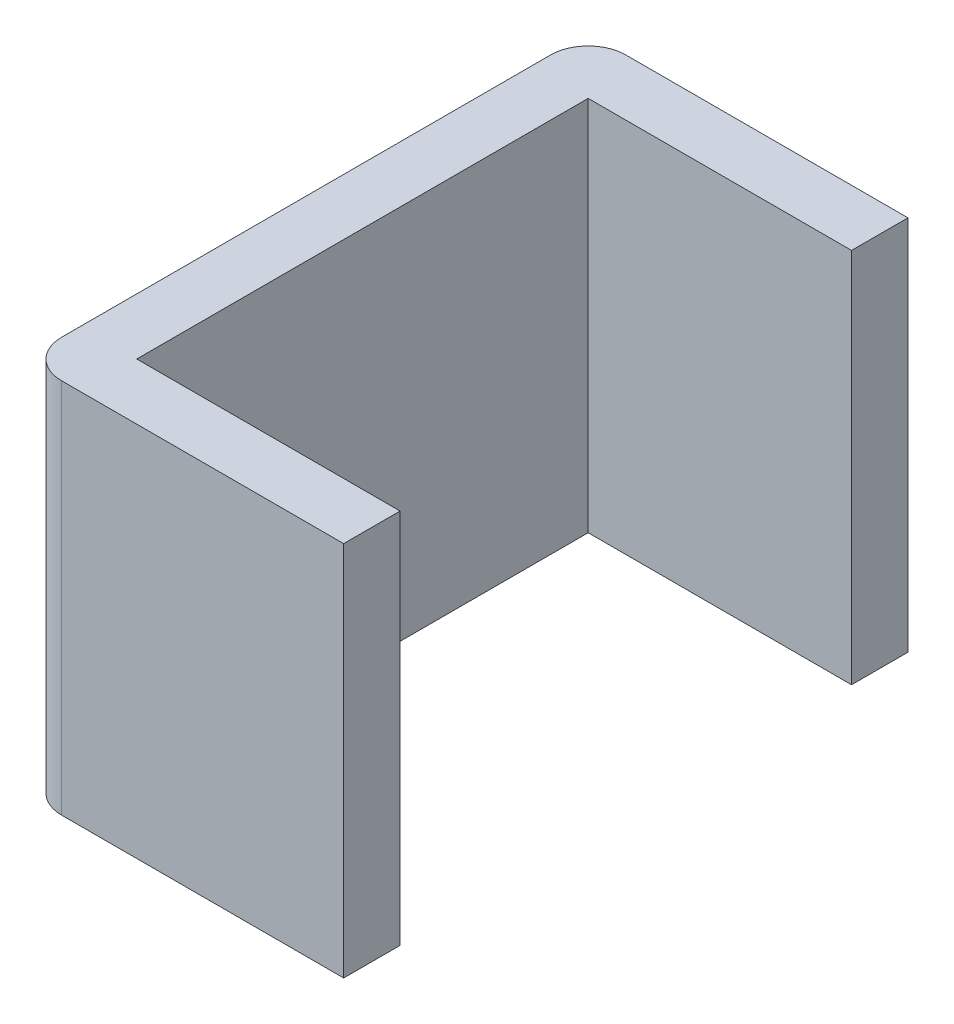
ISO-10303-21;
HEADER;
FILE_DESCRIPTION(('STEP AP214'),'2;1');
FILE_NAME('part.step','',(''),(''),'','','');
FILE_SCHEMA(('AUTOMOTIVE_DESIGN { 1 0 10303 214 1 1 1 1 }'));
ENDSEC;
DATA;
#1=APPLICATION_CONTEXT('core data for automotive mechanical design processes');
#2=APPLICATION_PROTOCOL_DEFINITION('international standard','automotive_design',2000,#1);
#3=PRODUCT_CONTEXT('',#1,'mechanical');
#4=PRODUCT('Part','Part','',(#3));
#5=PRODUCT_RELATED_PRODUCT_CATEGORY('part','',(#4));
#6=PRODUCT_DEFINITION_FORMATION('','',#4);
#7=PRODUCT_DEFINITION_CONTEXT('part definition',#1,'design');
#8=PRODUCT_DEFINITION('design','',#6,#7);
#9=PRODUCT_DEFINITION_SHAPE('','',#8);
#10=(LENGTH_UNIT() NAMED_UNIT(*) SI_UNIT(.MILLI.,.METRE.));
#11=(NAMED_UNIT(*) PLANE_ANGLE_UNIT() SI_UNIT($,.RADIAN.));
#12=(NAMED_UNIT(*) SI_UNIT($,.STERADIAN.) SOLID_ANGLE_UNIT());
#13=UNCERTAINTY_MEASURE_WITH_UNIT(LENGTH_MEASURE(1.E-05),#10,'distance_accuracy_value','');
#14=(GEOMETRIC_REPRESENTATION_CONTEXT(3) GLOBAL_UNCERTAINTY_ASSIGNED_CONTEXT((#13)) GLOBAL_UNIT_ASSIGNED_CONTEXT((#10,
#11,#12)) REPRESENTATION_CONTEXT('',''));
#15=CARTESIAN_POINT('',(0.,0.,0.));
#16=DIRECTION('',(0.,0.,1.));
#17=DIRECTION('',(1.,0.,0.));
#18=AXIS2_PLACEMENT_3D('',#15,#16,#17);
#19=CARTESIAN_POINT('',(0.,20.,-3.));
#20=DIRECTION('',(-1.,0.,0.));
#21=DIRECTION('',(0.,0.,1.));
#22=AXIS2_PLACEMENT_3D('',#19,#20,#21);
#23=PLANE('',#22);
#24=DIRECTION('',(0.,0.,-1.));
#25=VECTOR('',#24,1.);
#26=CARTESIAN_POINT('',(0.,0.,-3.));
#27=LINE('',#26,#25);
#28=CARTESIAN_POINT('',(0.,0.,0.));
#29=VERTEX_POINT('',#28);
#30=CARTESIAN_POINT('',(0.,0.,-3.));
#31=VERTEX_POINT('',#30);
#32=EDGE_CURVE('E143',#29,#31,#27,.T.);
#33=ORIENTED_EDGE('',*,*,#32,.T.);
#34=DIRECTION('',(0.,-1.,0.));
#35=VECTOR('',#34,1.);
#36=CARTESIAN_POINT('',(0.,20.,-3.));
#37=LINE('',#36,#35);
#38=CARTESIAN_POINT('',(0.,20.,-3.));
#39=VERTEX_POINT('',#38);
#40=EDGE_CURVE('E124',#39,#31,#37,.T.);
#41=ORIENTED_EDGE('',*,*,#40,.F.);
#42=DIRECTION('',(0.,0.,-1.));
#43=VECTOR('',#42,1.);
#44=CARTESIAN_POINT('',(0.,20.,-3.));
#45=LINE('',#44,#43);
#46=CARTESIAN_POINT('',(0.,20.,0.));
#47=VERTEX_POINT('',#46);
#48=EDGE_CURVE('E131',#47,#39,#45,.T.);
#49=ORIENTED_EDGE('',*,*,#48,.F.);
#50=DIRECTION('',(0.,-1.,0.));
#51=VECTOR('',#50,1.);
#52=CARTESIAN_POINT('',(0.,20.,0.));
#53=LINE('',#52,#51);
#54=EDGE_CURVE('E204',#47,#29,#53,.T.);
#55=ORIENTED_EDGE('',*,*,#54,.T.);
#56=EDGE_LOOP('',(#33,#41,#49,#55));
#57=FACE_BOUND('',#56,.T.);
#58=ADVANCED_FACE('F39',(#57),#23,.F.);
#59=CARTESIAN_POINT('',(0.,20.,-3.));
#60=DIRECTION('',(0.,0.,1.));
#61=DIRECTION('',(1.,0.,0.));
#62=AXIS2_PLACEMENT_3D('',#59,#60,#61);
#63=PLANE('',#62);
#64=DIRECTION('',(-1.,0.,0.));
#65=VECTOR('',#64,1.);
#66=CARTESIAN_POINT('',(0.,0.,-3.));
#67=LINE('',#66,#65);
#68=CARTESIAN_POINT('',(-14.,0.,-3.));
#69=VERTEX_POINT('',#68);
#70=EDGE_CURVE('E226',#31,#69,#67,.T.);
#71=ORIENTED_EDGE('',*,*,#70,.T.);
#72=DIRECTION('',(0.,-1.,0.));
#73=VECTOR('',#72,1.);
#74=CARTESIAN_POINT('',(-14.,20.,-3.));
#75=LINE('',#74,#73);
#76=CARTESIAN_POINT('',(-14.,20.,-3.));
#77=VERTEX_POINT('',#76);
#78=EDGE_CURVE('E127',#77,#69,#75,.T.);
#79=ORIENTED_EDGE('',*,*,#78,.F.);
#80=DIRECTION('',(-1.,0.,0.));
#81=VECTOR('',#80,1.);
#82=CARTESIAN_POINT('',(0.,20.,-3.));
#83=LINE('',#82,#81);
#84=EDGE_CURVE('E120',#39,#77,#83,.T.);
#85=ORIENTED_EDGE('',*,*,#84,.F.);
#86=ORIENTED_EDGE('',*,*,#40,.T.);
#87=EDGE_LOOP('',(#71,#79,#85,#86));
#88=FACE_BOUND('',#87,.T.);
#89=ADVANCED_FACE('F122',(#88),#63,.F.);
#90=CARTESIAN_POINT('',(-14.,20.,-3.));
#91=DIRECTION('',(-1.,0.,0.));
#92=DIRECTION('',(0.,0.,1.));
#93=AXIS2_PLACEMENT_3D('',#90,#91,#92);
#94=PLANE('',#93);
#95=DIRECTION('',(0.,0.,-1.));
#96=VECTOR('',#95,1.);
#97=CARTESIAN_POINT('',(-14.,0.,-3.));
#98=LINE('',#97,#96);
#99=CARTESIAN_POINT('',(-14.,0.,-27.));
#100=VERTEX_POINT('',#99);
#101=EDGE_CURVE('E223',#69,#100,#98,.T.);
#102=ORIENTED_EDGE('',*,*,#101,.T.);
#103=DIRECTION('',(0.,-1.,0.));
#104=VECTOR('',#103,1.);
#105=CARTESIAN_POINT('',(-14.,20.,-27.));
#106=LINE('',#105,#104);
#107=CARTESIAN_POINT('',(-14.,20.,-27.));
#108=VERTEX_POINT('',#107);
#109=EDGE_CURVE('E151',#108,#100,#106,.T.);
#110=ORIENTED_EDGE('',*,*,#109,.F.);
#111=DIRECTION('',(0.,0.,-1.));
#112=VECTOR('',#111,1.);
#113=CARTESIAN_POINT('',(-14.,20.,-3.));
#114=LINE('',#113,#112);
#115=EDGE_CURVE('E130',#77,#108,#114,.T.);
#116=ORIENTED_EDGE('',*,*,#115,.F.);
#117=ORIENTED_EDGE('',*,*,#78,.T.);
#118=EDGE_LOOP('',(#102,#110,#116,#117));
#119=FACE_BOUND('',#118,.T.);
#120=ADVANCED_FACE('F243',(#119),#94,.F.);
#121=CARTESIAN_POINT('',(-14.,20.,-27.));
#122=DIRECTION('',(0.,0.,-1.));
#123=DIRECTION('',(-1.,0.,0.));
#124=AXIS2_PLACEMENT_3D('',#121,#122,#123);
#125=PLANE('',#124);
#126=DIRECTION('',(1.,0.,0.));
#127=VECTOR('',#126,1.);
#128=CARTESIAN_POINT('',(-14.,0.,-27.));
#129=LINE('',#128,#127);
#130=CARTESIAN_POINT('',(0.,0.,-27.));
#131=VERTEX_POINT('',#130);
#132=EDGE_CURVE('E198',#100,#131,#129,.T.);
#133=ORIENTED_EDGE('',*,*,#132,.T.);
#134=DIRECTION('',(0.,-1.,0.));
#135=VECTOR('',#134,1.);
#136=CARTESIAN_POINT('',(0.,20.,-27.));
#137=LINE('',#136,#135);
#138=CARTESIAN_POINT('',(0.,20.,-27.));
#139=VERTEX_POINT('',#138);
#140=EDGE_CURVE('E209',#139,#131,#137,.T.);
#141=ORIENTED_EDGE('',*,*,#140,.F.);
#142=DIRECTION('',(1.,0.,0.));
#143=VECTOR('',#142,1.);
#144=CARTESIAN_POINT('',(-14.,20.,-27.));
#145=LINE('',#144,#143);
#146=EDGE_CURVE('E220',#108,#139,#145,.T.);
#147=ORIENTED_EDGE('',*,*,#146,.F.);
#148=ORIENTED_EDGE('',*,*,#109,.T.);
#149=EDGE_LOOP('',(#133,#141,#147,#148));
#150=FACE_BOUND('',#149,.T.);
#151=ADVANCED_FACE('F218',(#150),#125,.F.);
#152=CARTESIAN_POINT('',(0.,20.,-30.));
#153=DIRECTION('',(-1.,0.,0.));
#154=DIRECTION('',(0.,0.,1.));
#155=AXIS2_PLACEMENT_3D('',#152,#153,#154);
#156=PLANE('',#155);
#157=DIRECTION('',(0.,0.,-1.));
#158=VECTOR('',#157,1.);
#159=CARTESIAN_POINT('',(0.,0.,-30.));
#160=LINE('',#159,#158);
#161=CARTESIAN_POINT('',(0.,0.,-30.));
#162=VERTEX_POINT('',#161);
#163=EDGE_CURVE('E193',#131,#162,#160,.T.);
#164=ORIENTED_EDGE('',*,*,#163,.T.);
#165=DIRECTION('',(0.,-1.,0.));
#166=VECTOR('',#165,1.);
#167=CARTESIAN_POINT('',(0.,20.,-30.));
#168=LINE('',#167,#166);
#169=CARTESIAN_POINT('',(0.,20.,-30.));
#170=VERTEX_POINT('',#169);
#171=EDGE_CURVE('E191',#170,#162,#168,.T.);
#172=ORIENTED_EDGE('',*,*,#171,.F.);
#173=DIRECTION('',(0.,0.,-1.));
#174=VECTOR('',#173,1.);
#175=CARTESIAN_POINT('',(0.,20.,-30.));
#176=LINE('',#175,#174);
#177=EDGE_CURVE('E237',#139,#170,#176,.T.);
#178=ORIENTED_EDGE('',*,*,#177,.F.);
#179=ORIENTED_EDGE('',*,*,#140,.T.);
#180=EDGE_LOOP('',(#164,#172,#178,#179));
#181=FACE_BOUND('',#180,.T.);
#182=ADVANCED_FACE('F250',(#181),#156,.F.);
#183=CARTESIAN_POINT('',(-17.,20.,-30.));
#184=DIRECTION('',(0.,0.,1.));
#185=DIRECTION('',(1.,0.,0.));
#186=AXIS2_PLACEMENT_3D('',#183,#184,#185);
#187=PLANE('',#186);
#188=DIRECTION('',(-1.,0.,0.));
#189=VECTOR('',#188,1.);
#190=CARTESIAN_POINT('',(-17.,0.,-30.));
#191=LINE('',#190,#189);
#192=CARTESIAN_POINT('',(-15.,0.,-30.));
#193=VERTEX_POINT('',#192);
#194=EDGE_CURVE('E186',#162,#193,#191,.T.);
#195=ORIENTED_EDGE('',*,*,#194,.T.);
#196=DIRECTION('',(0.,-1.,0.));
#197=VECTOR('',#196,1.);
#198=CARTESIAN_POINT('',(-15.,20.,-30.));
#199=LINE('',#198,#197);
#200=CARTESIAN_POINT('',(-15.,20.,-30.));
#201=VERTEX_POINT('',#200);
#202=EDGE_CURVE('E63',#193,#201,#199,.F.);
#203=ORIENTED_EDGE('',*,*,#202,.T.);
#204=DIRECTION('',(-1.,0.,0.));
#205=VECTOR('',#204,1.);
#206=CARTESIAN_POINT('',(-17.,20.,-30.));
#207=LINE('',#206,#205);
#208=EDGE_CURVE('E171',#170,#201,#207,.T.);
#209=ORIENTED_EDGE('',*,*,#208,.F.);
#210=ORIENTED_EDGE('',*,*,#171,.T.);
#211=EDGE_LOOP('',(#195,#203,#209,#210));
#212=FACE_BOUND('',#211,.T.);
#213=ADVANCED_FACE('F189',(#212),#187,.F.);
#214=CARTESIAN_POINT('',(-17.,20.,0.));
#215=DIRECTION('',(1.,0.,0.));
#216=DIRECTION('',(0.,0.,-1.));
#217=AXIS2_PLACEMENT_3D('',#214,#215,#216);
#218=PLANE('',#217);
#219=DIRECTION('',(0.,0.,1.));
#220=VECTOR('',#219,1.);
#221=CARTESIAN_POINT('',(-17.,20.,0.));
#222=LINE('',#221,#220);
#223=CARTESIAN_POINT('',(-17.,20.,-28.));
#224=VERTEX_POINT('',#223);
#225=CARTESIAN_POINT('',(-17.,20.,-2.));
#226=VERTEX_POINT('',#225);
#227=EDGE_CURVE('E170',#224,#226,#222,.T.);
#228=ORIENTED_EDGE('',*,*,#227,.F.);
#229=DIRECTION('',(0.,-1.,0.));
#230=VECTOR('',#229,1.);
#231=CARTESIAN_POINT('',(-17.,20.,-28.));
#232=LINE('',#231,#230);
#233=CARTESIAN_POINT('',(-17.,0.,-28.));
#234=VERTEX_POINT('',#233);
#235=EDGE_CURVE('E149',#224,#234,#232,.T.);
#236=ORIENTED_EDGE('',*,*,#235,.T.);
#237=DIRECTION('',(0.,0.,1.));
#238=VECTOR('',#237,1.);
#239=CARTESIAN_POINT('',(-17.,0.,0.));
#240=LINE('',#239,#238);
#241=CARTESIAN_POINT('',(-17.,0.,-2.));
#242=VERTEX_POINT('',#241);
#243=EDGE_CURVE('E187',#234,#242,#240,.T.);
#244=ORIENTED_EDGE('',*,*,#243,.T.);
#245=DIRECTION('',(0.,-1.,0.));
#246=VECTOR('',#245,1.);
#247=CARTESIAN_POINT('',(-17.,20.,-2.));
#248=LINE('',#247,#246);
#249=EDGE_CURVE('E145',#242,#226,#248,.F.);
#250=ORIENTED_EDGE('',*,*,#249,.T.);
#251=EDGE_LOOP('',(#228,#236,#244,#250));
#252=FACE_BOUND('',#251,.T.);
#253=ADVANCED_FACE('F175',(#252),#218,.F.);
#254=CARTESIAN_POINT('',(0.,20.,0.));
#255=DIRECTION('',(0.,0.,-1.));
#256=DIRECTION('',(-1.,0.,0.));
#257=AXIS2_PLACEMENT_3D('',#254,#255,#256);
#258=PLANE('',#257);
#259=DIRECTION('',(1.,0.,0.));
#260=VECTOR('',#259,1.);
#261=CARTESIAN_POINT('',(0.,20.,0.));
#262=LINE('',#261,#260);
#263=CARTESIAN_POINT('',(-15.,20.,0.));
#264=VERTEX_POINT('',#263);
#265=EDGE_CURVE('E135',#264,#47,#262,.T.);
#266=ORIENTED_EDGE('',*,*,#265,.F.);
#267=DIRECTION('',(0.,-1.,0.));
#268=VECTOR('',#267,1.);
#269=CARTESIAN_POINT('',(-15.,20.,0.));
#270=LINE('',#269,#268);
#271=CARTESIAN_POINT('',(-15.,0.,0.));
#272=VERTEX_POINT('',#271);
#273=EDGE_CURVE('E11',#264,#272,#270,.T.);
#274=ORIENTED_EDGE('',*,*,#273,.T.);
#275=DIRECTION('',(1.,0.,0.));
#276=VECTOR('',#275,1.);
#277=CARTESIAN_POINT('',(0.,0.,0.));
#278=LINE('',#277,#276);
#279=EDGE_CURVE('E140',#272,#29,#278,.T.);
#280=ORIENTED_EDGE('',*,*,#279,.T.);
#281=ORIENTED_EDGE('',*,*,#54,.F.);
#282=EDGE_LOOP('',(#266,#274,#280,#281));
#283=FACE_BOUND('',#282,.T.);
#284=ADVANCED_FACE('F267',(#283),#258,.F.);
#285=CARTESIAN_POINT('',(0.,20.,0.));
#286=DIRECTION('',(0.,-1.,0.));
#287=DIRECTION('',(0.,0.,-1.));
#288=AXIS2_PLACEMENT_3D('',#285,#286,#287);
#289=PLANE('',#288);
#290=ORIENTED_EDGE('',*,*,#208,.T.);
#291=CARTESIAN_POINT('',(-15.,20.,-28.));
#292=DIRECTION('',(0.,-1.,0.));
#293=DIRECTION('',(0.,0.,-1.));
#294=AXIS2_PLACEMENT_3D('',#291,#292,#293);
#295=CIRCLE('',#294,2.);
#296=EDGE_CURVE('E48',#201,#224,#295,.F.);
#297=ORIENTED_EDGE('',*,*,#296,.T.);
#298=ORIENTED_EDGE('',*,*,#227,.T.);
#299=CARTESIAN_POINT('',(-15.,20.,-2.));
#300=DIRECTION('',(0.,-1.,0.));
#301=DIRECTION('',(0.,0.,-1.));
#302=AXIS2_PLACEMENT_3D('',#299,#300,#301);
#303=CIRCLE('',#302,2.);
#304=EDGE_CURVE('E55',#226,#264,#303,.F.);
#305=ORIENTED_EDGE('',*,*,#304,.T.);
#306=ORIENTED_EDGE('',*,*,#265,.T.);
#307=ORIENTED_EDGE('',*,*,#48,.T.);
#308=ORIENTED_EDGE('',*,*,#84,.T.);
#309=ORIENTED_EDGE('',*,*,#115,.T.);
#310=ORIENTED_EDGE('',*,*,#146,.T.);
#311=ORIENTED_EDGE('',*,*,#177,.T.);
#312=EDGE_LOOP('',(#290,#297,#298,#305,#306,#307,#308,#309,#310,#311));
#313=FACE_BOUND('',#312,.T.);
#314=ADVANCED_FACE('F134',(#313),#289,.F.);
#315=CARTESIAN_POINT('',(0.,0.,0.));
#316=DIRECTION('',(0.,-1.,0.));
#317=DIRECTION('',(0.,0.,-1.));
#318=AXIS2_PLACEMENT_3D('',#315,#316,#317);
#319=PLANE('',#318);
#320=ORIENTED_EDGE('',*,*,#243,.F.);
#321=CARTESIAN_POINT('',(-15.,0.,-28.));
#322=DIRECTION('',(0.,-1.,0.));
#323=DIRECTION('',(0.,0.,-1.));
#324=AXIS2_PLACEMENT_3D('',#321,#322,#323);
#325=CIRCLE('',#324,2.);
#326=EDGE_CURVE('E161',#234,#193,#325,.T.);
#327=ORIENTED_EDGE('',*,*,#326,.T.);
#328=ORIENTED_EDGE('',*,*,#194,.F.);
#329=ORIENTED_EDGE('',*,*,#163,.F.);
#330=ORIENTED_EDGE('',*,*,#132,.F.);
#331=ORIENTED_EDGE('',*,*,#101,.F.);
#332=ORIENTED_EDGE('',*,*,#70,.F.);
#333=ORIENTED_EDGE('',*,*,#32,.F.);
#334=ORIENTED_EDGE('',*,*,#279,.F.);
#335=CARTESIAN_POINT('',(-15.,0.,-2.));
#336=DIRECTION('',(0.,-1.,0.));
#337=DIRECTION('',(0.,0.,-1.));
#338=AXIS2_PLACEMENT_3D('',#335,#336,#337);
#339=CIRCLE('',#338,2.);
#340=EDGE_CURVE('E158',#272,#242,#339,.T.);
#341=ORIENTED_EDGE('',*,*,#340,.T.);
#342=EDGE_LOOP('',(#320,#327,#328,#329,#330,#331,#332,#333,#334,#341));
#343=FACE_BOUND('',#342,.T.);
#344=ADVANCED_FACE('F184',(#343),#319,.T.);
#345=CARTESIAN_POINT('',(-15.,20.,-28.));
#346=DIRECTION('',(0.,-1.,0.));
#347=DIRECTION('',(0.,0.,-1.));
#348=AXIS2_PLACEMENT_3D('',#345,#346,#347);
#349=CYLINDRICAL_SURFACE('',#348,2.);
#350=ORIENTED_EDGE('',*,*,#296,.F.);
#351=ORIENTED_EDGE('',*,*,#202,.F.);
#352=ORIENTED_EDGE('',*,*,#326,.F.);
#353=ORIENTED_EDGE('',*,*,#235,.F.);
#354=EDGE_LOOP('',(#350,#351,#352,#353));
#355=FACE_BOUND('',#354,.T.);
#356=ADVANCED_FACE('F181',(#355),#349,.T.);
#357=CARTESIAN_POINT('',(-15.,20.,-2.));
#358=DIRECTION('',(0.,-1.,0.));
#359=DIRECTION('',(0.,0.,-1.));
#360=AXIS2_PLACEMENT_3D('',#357,#358,#359);
#361=CYLINDRICAL_SURFACE('',#360,2.);
#362=ORIENTED_EDGE('',*,*,#304,.F.);
#363=ORIENTED_EDGE('',*,*,#249,.F.);
#364=ORIENTED_EDGE('',*,*,#340,.F.);
#365=ORIENTED_EDGE('',*,*,#273,.F.);
#366=EDGE_LOOP('',(#362,#363,#364,#365));
#367=FACE_BOUND('',#366,.T.);
#368=ADVANCED_FACE('F41',(#367),#361,.T.);
#369=CLOSED_SHELL('',(#58,#89,#120,#151,#182,#213,#253,#284,#314,#344,#356,#368));
#370=MANIFOLD_SOLID_BREP('B2',#369);
#371=ADVANCED_BREP_SHAPE_REPRESENTATION('',(#18,#370),#14);
#372=SHAPE_DEFINITION_REPRESENTATION(#9,#371);
ENDSEC;
END-ISO-10303-21;
